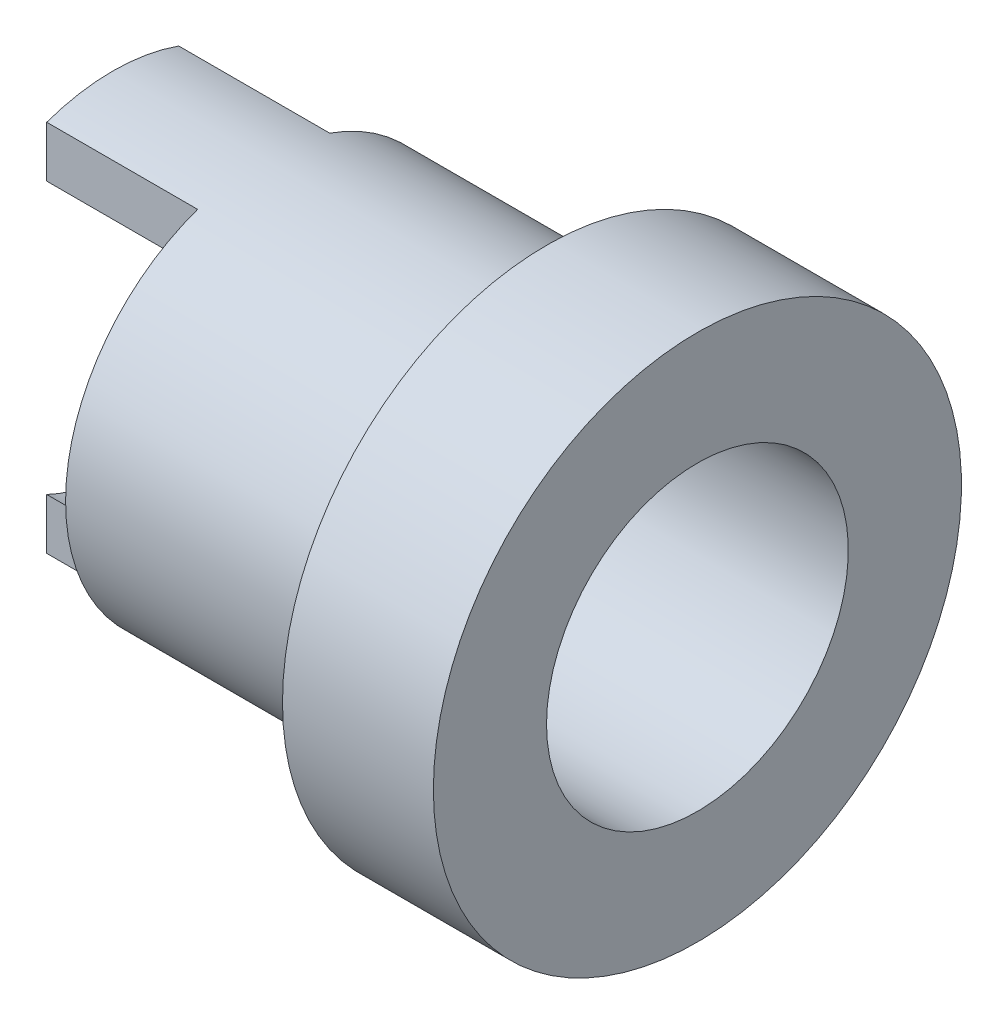
ISO-10303-21;
HEADER;
FILE_DESCRIPTION(('STEP AP214'),'2;1');
FILE_NAME('part.step','',(''),(''),'','','');
FILE_SCHEMA(('AUTOMOTIVE_DESIGN { 1 0 10303 214 1 1 1 1 }'));
ENDSEC;
DATA;
#1=APPLICATION_CONTEXT('core data for automotive mechanical design processes');
#2=APPLICATION_PROTOCOL_DEFINITION('international standard','automotive_design',2000,#1);
#3=PRODUCT_CONTEXT('',#1,'mechanical');
#4=PRODUCT('Part','Part','',(#3));
#5=PRODUCT_RELATED_PRODUCT_CATEGORY('part','',(#4));
#6=PRODUCT_DEFINITION_FORMATION('','',#4);
#7=PRODUCT_DEFINITION_CONTEXT('part definition',#1,'design');
#8=PRODUCT_DEFINITION('design','',#6,#7);
#9=PRODUCT_DEFINITION_SHAPE('','',#8);
#10=(LENGTH_UNIT() NAMED_UNIT(*) SI_UNIT(.MILLI.,.METRE.));
#11=(NAMED_UNIT(*) PLANE_ANGLE_UNIT() SI_UNIT($,.RADIAN.));
#12=(NAMED_UNIT(*) SI_UNIT($,.STERADIAN.) SOLID_ANGLE_UNIT());
#13=UNCERTAINTY_MEASURE_WITH_UNIT(LENGTH_MEASURE(1.E-05),#10,'distance_accuracy_value','');
#14=(GEOMETRIC_REPRESENTATION_CONTEXT(3) GLOBAL_UNCERTAINTY_ASSIGNED_CONTEXT((#13)) GLOBAL_UNIT_ASSIGNED_CONTEXT((#10,
#11,#12)) REPRESENTATION_CONTEXT('',''));
#15=CARTESIAN_POINT('',(0.,0.,0.));
#16=DIRECTION('',(0.,0.,1.));
#17=DIRECTION('',(1.,0.,0.));
#18=AXIS2_PLACEMENT_3D('',#15,#16,#17);
#19=CARTESIAN_POINT('',(-15.5,0.,-5.25));
#20=DIRECTION('',(1.,0.,0.));
#21=DIRECTION('',(0.,0.,-1.));
#22=AXIS2_PLACEMENT_3D('',#19,#20,#21);
#23=PLANE('',#22);
#24=CARTESIAN_POINT('',(-15.5,0.,0.));
#25=DIRECTION('',(-1.,0.,0.));
#26=DIRECTION('',(0.,0.,1.));
#27=AXIS2_PLACEMENT_3D('',#24,#25,#26);
#28=CIRCLE('',#27,5.25);
#29=CARTESIAN_POINT('',(-15.5,4.94974746830583,1.74999999999999));
#30=VERTEX_POINT('',#29);
#31=CARTESIAN_POINT('',(-15.5,4.94974746830583,-1.75));
#32=VERTEX_POINT('',#31);
#33=EDGE_CURVE('E157',#30,#32,#28,.T.);
#34=ORIENTED_EDGE('',*,*,#33,.T.);
#35=DIRECTION('',(0.,-1.,0.));
#36=VECTOR('',#35,1.);
#37=CARTESIAN_POINT('',(-15.5,0.,-1.75));
#38=LINE('',#37,#36);
#39=CARTESIAN_POINT('',(-15.5,3.59687364248454,-1.75));
#40=VERTEX_POINT('',#39);
#41=EDGE_CURVE('E121',#32,#40,#38,.T.);
#42=ORIENTED_EDGE('',*,*,#41,.T.);
#43=CARTESIAN_POINT('',(-15.5,0.,0.));
#44=DIRECTION('',(-1.,0.,0.));
#45=DIRECTION('',(0.,0.,1.));
#46=AXIS2_PLACEMENT_3D('',#43,#44,#45);
#47=CIRCLE('',#46,4.);
#48=CARTESIAN_POINT('',(-15.5,3.59687364248454,1.75));
#49=VERTEX_POINT('',#48);
#50=EDGE_CURVE('E151',#49,#40,#47,.T.);
#51=ORIENTED_EDGE('',*,*,#50,.F.);
#52=DIRECTION('',(0.,-1.,0.));
#53=VECTOR('',#52,1.);
#54=CARTESIAN_POINT('',(-15.5,4.94974746830583,1.75));
#55=LINE('',#54,#53);
#56=EDGE_CURVE('E132',#30,#49,#55,.T.);
#57=ORIENTED_EDGE('',*,*,#56,.F.);
#58=EDGE_LOOP('',(#34,#42,#51,#57));
#59=FACE_BOUND('',#58,.T.);
#60=ADVANCED_FACE('F34',(#59),#23,.F.);
#61=CARTESIAN_POINT('',(-5.13466577621824,0.,0.));
#62=DIRECTION('',(-1.,0.,0.));
#63=DIRECTION('',(0.,0.,1.));
#64=AXIS2_PLACEMENT_3D('',#61,#62,#63);
#65=CYLINDRICAL_SURFACE('',#64,4.);
#66=ORIENTED_EDGE('',*,*,#50,.T.);
#67=DIRECTION('',(-1.,0.,0.));
#68=VECTOR('',#67,1.);
#69=CARTESIAN_POINT('',(-5.13466577621824,3.59687364248454,-1.75));
#70=LINE('',#69,#68);
#71=CARTESIAN_POINT('',(-11.5,3.59687364248454,-1.75));
#72=VERTEX_POINT('',#71);
#73=EDGE_CURVE('E145',#40,#72,#70,.F.);
#74=ORIENTED_EDGE('',*,*,#73,.T.);
#75=CARTESIAN_POINT('',(-11.5,0.,0.));
#76=DIRECTION('',(1.,0.,0.));
#77=DIRECTION('',(0.,0.,-1.));
#78=AXIS2_PLACEMENT_3D('',#75,#76,#77);
#79=CIRCLE('',#78,4.);
#80=CARTESIAN_POINT('',(-11.5,-3.59687364248454,-1.75));
#81=VERTEX_POINT('',#80);
#82=EDGE_CURVE('E113',#72,#81,#79,.F.);
#83=ORIENTED_EDGE('',*,*,#82,.T.);
#84=DIRECTION('',(-1.,0.,0.));
#85=VECTOR('',#84,1.);
#86=CARTESIAN_POINT('',(-5.13466577621824,-3.59687364248454,-1.75));
#87=LINE('',#86,#85);
#88=CARTESIAN_POINT('',(-15.5,-3.59687364248454,-1.75));
#89=VERTEX_POINT('',#88);
#90=EDGE_CURVE('E142',#81,#89,#87,.T.);
#91=ORIENTED_EDGE('',*,*,#90,.T.);
#92=CARTESIAN_POINT('',(-15.5,-3.59687364248454,1.75));
#93=VERTEX_POINT('',#92);
#94=EDGE_CURVE('E150',#89,#93,#47,.T.);
#95=ORIENTED_EDGE('',*,*,#94,.T.);
#96=DIRECTION('',(-1.,0.,0.));
#97=VECTOR('',#96,1.);
#98=CARTESIAN_POINT('',(-5.13466577621824,-3.59687364248454,1.75));
#99=LINE('',#98,#97);
#100=CARTESIAN_POINT('',(-11.5,-3.59687364248454,1.75));
#101=VERTEX_POINT('',#100);
#102=EDGE_CURVE('E139',#93,#101,#99,.F.);
#103=ORIENTED_EDGE('',*,*,#102,.T.);
#104=CARTESIAN_POINT('',(-11.5,0.,0.));
#105=DIRECTION('',(-1.,0.,0.));
#106=DIRECTION('',(0.,0.,1.));
#107=AXIS2_PLACEMENT_3D('',#104,#105,#106);
#108=CIRCLE('',#107,4.);
#109=CARTESIAN_POINT('',(-11.5,3.59687364248454,1.75));
#110=VERTEX_POINT('',#109);
#111=EDGE_CURVE('E147',#110,#101,#108,.F.);
#112=ORIENTED_EDGE('',*,*,#111,.F.);
#113=DIRECTION('',(-1.,0.,0.));
#114=VECTOR('',#113,1.);
#115=CARTESIAN_POINT('',(-5.13466577621824,3.59687364248454,1.75));
#116=LINE('',#115,#114);
#117=EDGE_CURVE('E123',#110,#49,#116,.T.);
#118=ORIENTED_EDGE('',*,*,#117,.T.);
#119=EDGE_LOOP('',(#66,#74,#83,#91,#95,#103,#112,#118));
#120=FACE_BOUND('',#119,.T.);
#121=CARTESIAN_POINT('',(0.,0.,0.));
#122=DIRECTION('',(-1.,0.,0.));
#123=DIRECTION('',(0.,0.,1.));
#124=AXIS2_PLACEMENT_3D('',#121,#122,#123);
#125=CIRCLE('',#124,4.);
#126=CARTESIAN_POINT('',(0.,0.,4.));
#127=VERTEX_POINT('',#126);
#128=EDGE_CURVE('E167',#127,#127,#125,.T.);
#129=ORIENTED_EDGE('',*,*,#128,.F.);
#130=EDGE_LOOP('',(#129));
#131=FACE_BOUND('',#130,.T.);
#132=ADVANCED_FACE('F36',(#120,#131),#65,.F.);
#133=CARTESIAN_POINT('',(0.,0.,-4.));
#134=DIRECTION('',(-1.,0.,0.));
#135=DIRECTION('',(0.,0.,1.));
#136=AXIS2_PLACEMENT_3D('',#133,#134,#135);
#137=PLANE('',#136);
#138=CARTESIAN_POINT('',(0.,0.,0.));
#139=DIRECTION('',(-1.,0.,0.));
#140=DIRECTION('',(0.,0.,1.));
#141=AXIS2_PLACEMENT_3D('',#138,#139,#140);
#142=CIRCLE('',#141,7.);
#143=CARTESIAN_POINT('',(0.,0.,7.));
#144=VERTEX_POINT('',#143);
#145=EDGE_CURVE('E164',#144,#144,#142,.T.);
#146=ORIENTED_EDGE('',*,*,#145,.F.);
#147=EDGE_LOOP('',(#146));
#148=FACE_BOUND('',#147,.T.);
#149=ORIENTED_EDGE('',*,*,#128,.T.);
#150=EDGE_LOOP('',(#149));
#151=FACE_BOUND('',#150,.T.);
#152=ADVANCED_FACE('F203',(#148,#151),#137,.F.);
#153=CARTESIAN_POINT('',(-5.13466577621824,0.,0.));
#154=DIRECTION('',(-1.,0.,0.));
#155=DIRECTION('',(0.,0.,1.));
#156=AXIS2_PLACEMENT_3D('',#153,#154,#155);
#157=CYLINDRICAL_SURFACE('',#156,7.);
#158=CARTESIAN_POINT('',(-4.,0.,0.));
#159=DIRECTION('',(-1.,0.,0.));
#160=DIRECTION('',(0.,0.,1.));
#161=AXIS2_PLACEMENT_3D('',#158,#159,#160);
#162=CIRCLE('',#161,7.);
#163=CARTESIAN_POINT('',(-4.,0.,7.));
#164=VERTEX_POINT('',#163);
#165=EDGE_CURVE('E161',#164,#164,#162,.T.);
#166=ORIENTED_EDGE('',*,*,#165,.F.);
#167=EDGE_LOOP('',(#166));
#168=FACE_BOUND('',#167,.T.);
#169=ORIENTED_EDGE('',*,*,#145,.T.);
#170=EDGE_LOOP('',(#169));
#171=FACE_BOUND('',#170,.T.);
#172=ADVANCED_FACE('F215',(#168,#171),#157,.T.);
#173=CARTESIAN_POINT('',(-4.,0.,-7.));
#174=DIRECTION('',(1.,0.,0.));
#175=DIRECTION('',(0.,0.,-1.));
#176=AXIS2_PLACEMENT_3D('',#173,#174,#175);
#177=PLANE('',#176);
#178=CARTESIAN_POINT('',(-4.,0.,0.));
#179=DIRECTION('',(-1.,0.,0.));
#180=DIRECTION('',(0.,0.,1.));
#181=AXIS2_PLACEMENT_3D('',#178,#179,#180);
#182=CIRCLE('',#181,5.25);
#183=CARTESIAN_POINT('',(-4.,0.,5.25));
#184=VERTEX_POINT('',#183);
#185=EDGE_CURVE('E158',#184,#184,#182,.T.);
#186=ORIENTED_EDGE('',*,*,#185,.F.);
#187=EDGE_LOOP('',(#186));
#188=FACE_BOUND('',#187,.T.);
#189=ORIENTED_EDGE('',*,*,#165,.T.);
#190=EDGE_LOOP('',(#189));
#191=FACE_BOUND('',#190,.T.);
#192=ADVANCED_FACE('F211',(#188,#191),#177,.F.);
#193=CARTESIAN_POINT('',(-5.13466577621824,0.,0.));
#194=DIRECTION('',(-1.,0.,0.));
#195=DIRECTION('',(0.,0.,1.));
#196=AXIS2_PLACEMENT_3D('',#193,#194,#195);
#197=CYLINDRICAL_SURFACE('',#196,5.25);
#198=CARTESIAN_POINT('',(-15.5,-4.94974746830583,-1.74999999999999));
#199=VERTEX_POINT('',#198);
#200=CARTESIAN_POINT('',(-15.5,-4.94974746830583,1.75));
#201=VERTEX_POINT('',#200);
#202=EDGE_CURVE('E154',#199,#201,#28,.T.);
#203=ORIENTED_EDGE('',*,*,#202,.F.);
#204=DIRECTION('',(-1.,0.,0.));
#205=VECTOR('',#204,1.);
#206=CARTESIAN_POINT('',(-11.5,-4.94974746830583,-1.75));
#207=LINE('',#206,#205);
#208=CARTESIAN_POINT('',(-11.5,-4.94974746830583,-1.75));
#209=VERTEX_POINT('',#208);
#210=EDGE_CURVE('E49',#209,#199,#207,.T.);
#211=ORIENTED_EDGE('',*,*,#210,.F.);
#212=CARTESIAN_POINT('',(-11.5,0.,0.));
#213=DIRECTION('',(1.,0.,0.));
#214=DIRECTION('',(0.,0.,-1.));
#215=AXIS2_PLACEMENT_3D('',#212,#213,#214);
#216=CIRCLE('',#215,5.25);
#217=CARTESIAN_POINT('',(-11.5,4.94974746830583,-1.75));
#218=VERTEX_POINT('',#217);
#219=EDGE_CURVE('E11',#209,#218,#216,.T.);
#220=ORIENTED_EDGE('',*,*,#219,.T.);
#221=DIRECTION('',(-1.,0.,0.));
#222=VECTOR('',#221,1.);
#223=CARTESIAN_POINT('',(-11.5,4.94974746830583,-1.75));
#224=LINE('',#223,#222);
#225=EDGE_CURVE('E105',#218,#32,#224,.T.);
#226=ORIENTED_EDGE('',*,*,#225,.T.);
#227=ORIENTED_EDGE('',*,*,#33,.F.);
#228=DIRECTION('',(-1.,0.,0.));
#229=VECTOR('',#228,1.);
#230=CARTESIAN_POINT('',(-11.5,4.94974746830583,1.75));
#231=LINE('',#230,#229);
#232=CARTESIAN_POINT('',(-11.5,4.94974746830583,1.75));
#233=VERTEX_POINT('',#232);
#234=EDGE_CURVE('E57',#233,#30,#231,.T.);
#235=ORIENTED_EDGE('',*,*,#234,.F.);
#236=CARTESIAN_POINT('',(-11.5,0.,0.));
#237=DIRECTION('',(-1.,0.,0.));
#238=DIRECTION('',(0.,0.,1.));
#239=AXIS2_PLACEMENT_3D('',#236,#237,#238);
#240=CIRCLE('',#239,5.25);
#241=CARTESIAN_POINT('',(-11.5,-4.94974746830583,1.75));
#242=VERTEX_POINT('',#241);
#243=EDGE_CURVE('E42',#242,#233,#240,.T.);
#244=ORIENTED_EDGE('',*,*,#243,.F.);
#245=DIRECTION('',(-1.,0.,0.));
#246=VECTOR('',#245,1.);
#247=CARTESIAN_POINT('',(-11.5,-4.94974746830583,1.75));
#248=LINE('',#247,#246);
#249=EDGE_CURVE('E130',#242,#201,#248,.T.);
#250=ORIENTED_EDGE('',*,*,#249,.T.);
#251=EDGE_LOOP('',(#203,#211,#220,#226,#227,#235,#244,#250));
#252=FACE_BOUND('',#251,.T.);
#253=ORIENTED_EDGE('',*,*,#185,.T.);
#254=EDGE_LOOP('',(#253));
#255=FACE_BOUND('',#254,.T.);
#256=ADVANCED_FACE('F101',(#252,#255),#197,.T.);
#257=ORIENTED_EDGE('',*,*,#94,.F.);
#258=DIRECTION('',(0.,1.,0.));
#259=VECTOR('',#258,1.);
#260=CARTESIAN_POINT('',(-15.5,4.94974746830583,-1.75));
#261=LINE('',#260,#259);
#262=EDGE_CURVE('E117',#199,#89,#261,.T.);
#263=ORIENTED_EDGE('',*,*,#262,.F.);
#264=ORIENTED_EDGE('',*,*,#202,.T.);
#265=DIRECTION('',(0.,1.,0.));
#266=VECTOR('',#265,1.);
#267=CARTESIAN_POINT('',(-15.5,0.,1.75));
#268=LINE('',#267,#266);
#269=EDGE_CURVE('E170',#201,#93,#268,.T.);
#270=ORIENTED_EDGE('',*,*,#269,.T.);
#271=EDGE_LOOP('',(#257,#263,#264,#270));
#272=FACE_BOUND('',#271,.T.);
#273=ADVANCED_FACE('F189',(#272),#23,.F.);
#274=CARTESIAN_POINT('',(-11.5,0.,0.));
#275=DIRECTION('',(-1.,0.,0.));
#276=DIRECTION('',(0.,0.,1.));
#277=AXIS2_PLACEMENT_3D('',#274,#275,#276);
#278=PLANE('',#277);
#279=ORIENTED_EDGE('',*,*,#111,.T.);
#280=DIRECTION('',(0.,-1.,0.));
#281=VECTOR('',#280,1.);
#282=CARTESIAN_POINT('',(-11.5,4.94974746830583,1.75));
#283=LINE('',#282,#281);
#284=EDGE_CURVE('E131',#101,#242,#283,.T.);
#285=ORIENTED_EDGE('',*,*,#284,.T.);
#286=ORIENTED_EDGE('',*,*,#243,.T.);
#287=EDGE_CURVE('E127',#233,#110,#283,.T.);
#288=ORIENTED_EDGE('',*,*,#287,.T.);
#289=EDGE_LOOP('',(#279,#285,#286,#288));
#290=FACE_BOUND('',#289,.T.);
#291=ADVANCED_FACE('F175',(#290),#278,.T.);
#292=CARTESIAN_POINT('',(-11.5,4.94974746830583,1.75));
#293=DIRECTION('',(0.,0.,-1.));
#294=DIRECTION('',(-1.,0.,0.));
#295=AXIS2_PLACEMENT_3D('',#292,#293,#294);
#296=PLANE('',#295);
#297=ORIENTED_EDGE('',*,*,#269,.F.);
#298=ORIENTED_EDGE('',*,*,#249,.F.);
#299=ORIENTED_EDGE('',*,*,#284,.F.);
#300=ORIENTED_EDGE('',*,*,#102,.F.);
#301=EDGE_LOOP('',(#297,#298,#299,#300));
#302=FACE_BOUND('',#301,.T.);
#303=ADVANCED_FACE('F186',(#302),#296,.F.);
#304=ORIENTED_EDGE('',*,*,#287,.F.);
#305=ORIENTED_EDGE('',*,*,#234,.T.);
#306=ORIENTED_EDGE('',*,*,#56,.T.);
#307=ORIENTED_EDGE('',*,*,#117,.F.);
#308=EDGE_LOOP('',(#304,#305,#306,#307));
#309=FACE_BOUND('',#308,.T.);
#310=ADVANCED_FACE('F179',(#309),#296,.F.);
#311=CARTESIAN_POINT('',(-11.5,0.,0.));
#312=DIRECTION('',(1.,0.,0.));
#313=DIRECTION('',(0.,0.,-1.));
#314=AXIS2_PLACEMENT_3D('',#311,#312,#313);
#315=PLANE('',#314);
#316=DIRECTION('',(0.,1.,0.));
#317=VECTOR('',#316,1.);
#318=CARTESIAN_POINT('',(-11.5,4.94974746830583,-1.75));
#319=LINE('',#318,#317);
#320=EDGE_CURVE('E110',#72,#218,#319,.T.);
#321=ORIENTED_EDGE('',*,*,#320,.T.);
#322=ORIENTED_EDGE('',*,*,#219,.F.);
#323=EDGE_CURVE('E116',#209,#81,#319,.T.);
#324=ORIENTED_EDGE('',*,*,#323,.T.);
#325=ORIENTED_EDGE('',*,*,#82,.F.);
#326=EDGE_LOOP('',(#321,#322,#324,#325));
#327=FACE_BOUND('',#326,.T.);
#328=ADVANCED_FACE('F111',(#327),#315,.F.);
#329=CARTESIAN_POINT('',(-11.5,4.94974746830583,-1.75));
#330=DIRECTION('',(0.,0.,1.));
#331=DIRECTION('',(1.,0.,0.));
#332=AXIS2_PLACEMENT_3D('',#329,#330,#331);
#333=PLANE('',#332);
#334=ORIENTED_EDGE('',*,*,#41,.F.);
#335=ORIENTED_EDGE('',*,*,#225,.F.);
#336=ORIENTED_EDGE('',*,*,#320,.F.);
#337=ORIENTED_EDGE('',*,*,#73,.F.);
#338=EDGE_LOOP('',(#334,#335,#336,#337));
#339=FACE_BOUND('',#338,.T.);
#340=ADVANCED_FACE('F119',(#339),#333,.F.);
#341=ORIENTED_EDGE('',*,*,#323,.F.);
#342=ORIENTED_EDGE('',*,*,#210,.T.);
#343=ORIENTED_EDGE('',*,*,#262,.T.);
#344=ORIENTED_EDGE('',*,*,#90,.F.);
#345=EDGE_LOOP('',(#341,#342,#343,#344));
#346=FACE_BOUND('',#345,.T.);
#347=ADVANCED_FACE('F190',(#346),#333,.F.);
#348=CLOSED_SHELL('',(#60,#132,#152,#172,#192,#256,#273,#291,#303,#310,#328,#340,#347));
#349=MANIFOLD_SOLID_BREP('B2',#348);
#350=ADVANCED_BREP_SHAPE_REPRESENTATION('',(#18,#349),#14);
#351=SHAPE_DEFINITION_REPRESENTATION(#9,#350);
ENDSEC;
END-ISO-10303-21;
